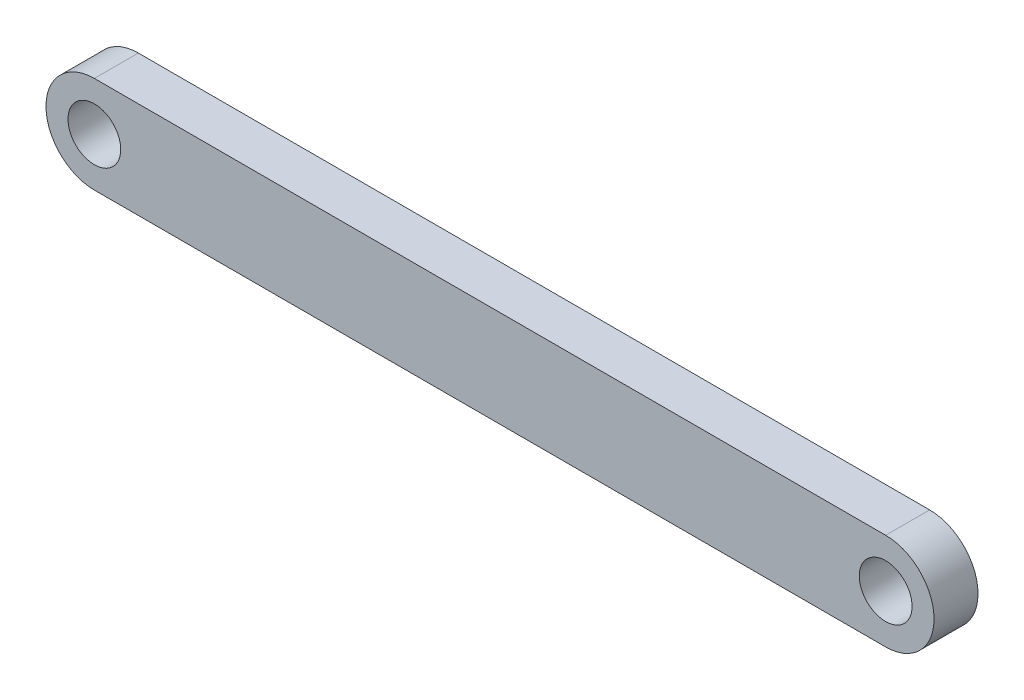
ISO-10303-21;
HEADER;
FILE_DESCRIPTION(('STEP AP214'),'2;1');
FILE_NAME('part.step','',(''),(''),'','','');
FILE_SCHEMA(('AUTOMOTIVE_DESIGN { 1 0 10303 214 1 1 1 1 }'));
ENDSEC;
DATA;
#1=APPLICATION_CONTEXT('core data for automotive mechanical design processes');
#2=APPLICATION_PROTOCOL_DEFINITION('international standard','automotive_design',2000,#1);
#3=PRODUCT_CONTEXT('',#1,'mechanical');
#4=PRODUCT('Part','Part','',(#3));
#5=PRODUCT_RELATED_PRODUCT_CATEGORY('part','',(#4));
#6=PRODUCT_DEFINITION_FORMATION('','',#4);
#7=PRODUCT_DEFINITION_CONTEXT('part definition',#1,'design');
#8=PRODUCT_DEFINITION('design','',#6,#7);
#9=PRODUCT_DEFINITION_SHAPE('','',#8);
#10=(LENGTH_UNIT() NAMED_UNIT(*) SI_UNIT(.MILLI.,.METRE.));
#11=(NAMED_UNIT(*) PLANE_ANGLE_UNIT() SI_UNIT($,.RADIAN.));
#12=(NAMED_UNIT(*) SI_UNIT($,.STERADIAN.) SOLID_ANGLE_UNIT());
#13=UNCERTAINTY_MEASURE_WITH_UNIT(LENGTH_MEASURE(1.E-05),#10,'distance_accuracy_value','');
#14=(GEOMETRIC_REPRESENTATION_CONTEXT(3) GLOBAL_UNCERTAINTY_ASSIGNED_CONTEXT((#13)) GLOBAL_UNIT_ASSIGNED_CONTEXT((#10,
#11,#12)) REPRESENTATION_CONTEXT('',''));
#15=CARTESIAN_POINT('',(0.,0.,0.));
#16=DIRECTION('',(0.,0.,1.));
#17=DIRECTION('',(1.,0.,0.));
#18=AXIS2_PLACEMENT_3D('',#15,#16,#17);
#19=CARTESIAN_POINT('',(-45.,0.,2.5));
#20=DIRECTION('',(0.,0.,1.));
#21=DIRECTION('',(1.,0.,0.));
#22=AXIS2_PLACEMENT_3D('',#19,#20,#21);
#23=PLANE('',#22);
#24=CARTESIAN_POINT('',(-45.,0.,2.5));
#25=DIRECTION('',(0.,0.,1.));
#26=DIRECTION('',(1.,0.,0.));
#27=AXIS2_PLACEMENT_3D('',#24,#25,#26);
#28=CIRCLE('',#27,3.);
#29=CARTESIAN_POINT('',(-42.,0.,2.5));
#30=VERTEX_POINT('',#29);
#31=EDGE_CURVE('E103',#30,#30,#28,.T.);
#32=ORIENTED_EDGE('',*,*,#31,.F.);
#33=EDGE_LOOP('',(#32));
#34=FACE_BOUND('',#33,.T.);
#35=CARTESIAN_POINT('',(-45.,0.,2.5));
#36=DIRECTION('',(0.,0.,1.));
#37=DIRECTION('',(1.,0.,0.));
#38=AXIS2_PLACEMENT_3D('',#35,#36,#37);
#39=CIRCLE('',#38,5.5);
#40=CARTESIAN_POINT('',(-45.,5.5,2.5));
#41=VERTEX_POINT('',#40);
#42=CARTESIAN_POINT('',(-45.,-5.5,2.5));
#43=VERTEX_POINT('',#42);
#44=EDGE_CURVE('E88',#41,#43,#39,.T.);
#45=ORIENTED_EDGE('',*,*,#44,.T.);
#46=DIRECTION('',(1.,0.,0.));
#47=VECTOR('',#46,1.);
#48=CARTESIAN_POINT('',(-45.,-5.5,2.5));
#49=LINE('',#48,#47);
#50=CARTESIAN_POINT('',(45.,-5.5,2.5));
#51=VERTEX_POINT('',#50);
#52=EDGE_CURVE('E83',#43,#51,#49,.T.);
#53=ORIENTED_EDGE('',*,*,#52,.T.);
#54=CARTESIAN_POINT('',(45.,0.,2.5));
#55=DIRECTION('',(0.,0.,1.));
#56=DIRECTION('',(1.,0.,0.));
#57=AXIS2_PLACEMENT_3D('',#54,#55,#56);
#58=CIRCLE('',#57,5.5);
#59=CARTESIAN_POINT('',(45.,5.5,2.5));
#60=VERTEX_POINT('',#59);
#61=EDGE_CURVE('E86',#51,#60,#58,.T.);
#62=ORIENTED_EDGE('',*,*,#61,.T.);
#63=DIRECTION('',(-1.,0.,0.));
#64=VECTOR('',#63,1.);
#65=CARTESIAN_POINT('',(-45.,5.5,2.5));
#66=LINE('',#65,#64);
#67=EDGE_CURVE('E53',#60,#41,#66,.T.);
#68=ORIENTED_EDGE('',*,*,#67,.T.);
#69=EDGE_LOOP('',(#45,#53,#62,#68));
#70=FACE_BOUND('',#69,.T.);
#71=CARTESIAN_POINT('',(45.,0.,2.5));
#72=DIRECTION('',(0.,0.,1.));
#73=DIRECTION('',(1.,0.,0.));
#74=AXIS2_PLACEMENT_3D('',#71,#72,#73);
#75=CIRCLE('',#74,3.);
#76=CARTESIAN_POINT('',(48.,0.,2.5));
#77=VERTEX_POINT('',#76);
#78=EDGE_CURVE('E118',#77,#77,#75,.T.);
#79=ORIENTED_EDGE('',*,*,#78,.F.);
#80=EDGE_LOOP('',(#79));
#81=FACE_BOUND('',#80,.T.);
#82=ADVANCED_FACE('F36',(#34,#70,#81),#23,.T.);
#83=CARTESIAN_POINT('',(-45.,0.,-2.5));
#84=DIRECTION('',(0.,0.,1.));
#85=DIRECTION('',(1.,0.,0.));
#86=AXIS2_PLACEMENT_3D('',#83,#84,#85);
#87=PLANE('',#86);
#88=CARTESIAN_POINT('',(-45.,0.,-2.5));
#89=DIRECTION('',(0.,0.,1.));
#90=DIRECTION('',(1.,0.,0.));
#91=AXIS2_PLACEMENT_3D('',#88,#89,#90);
#92=CIRCLE('',#91,5.5);
#93=CARTESIAN_POINT('',(-45.,5.5,-2.5));
#94=VERTEX_POINT('',#93);
#95=CARTESIAN_POINT('',(-45.,-5.5,-2.5));
#96=VERTEX_POINT('',#95);
#97=EDGE_CURVE('E100',#94,#96,#92,.T.);
#98=ORIENTED_EDGE('',*,*,#97,.F.);
#99=DIRECTION('',(-1.,0.,0.));
#100=VECTOR('',#99,1.);
#101=CARTESIAN_POINT('',(-45.,5.5,-2.5));
#102=LINE('',#101,#100);
#103=CARTESIAN_POINT('',(45.,5.5,-2.5));
#104=VERTEX_POINT('',#103);
#105=EDGE_CURVE('E76',#104,#94,#102,.T.);
#106=ORIENTED_EDGE('',*,*,#105,.F.);
#107=CARTESIAN_POINT('',(45.,0.,-2.5));
#108=DIRECTION('',(0.,0.,1.));
#109=DIRECTION('',(1.,0.,0.));
#110=AXIS2_PLACEMENT_3D('',#107,#108,#109);
#111=CIRCLE('',#110,5.5);
#112=CARTESIAN_POINT('',(45.,-5.5,-2.5));
#113=VERTEX_POINT('',#112);
#114=EDGE_CURVE('E70',#113,#104,#111,.T.);
#115=ORIENTED_EDGE('',*,*,#114,.F.);
#116=DIRECTION('',(1.,0.,0.));
#117=VECTOR('',#116,1.);
#118=CARTESIAN_POINT('',(-45.,-5.5,-2.5));
#119=LINE('',#118,#117);
#120=EDGE_CURVE('E92',#96,#113,#119,.T.);
#121=ORIENTED_EDGE('',*,*,#120,.F.);
#122=EDGE_LOOP('',(#98,#106,#115,#121));
#123=FACE_BOUND('',#122,.T.);
#124=CARTESIAN_POINT('',(-45.,0.,-2.5));
#125=DIRECTION('',(0.,0.,1.));
#126=DIRECTION('',(1.,0.,0.));
#127=AXIS2_PLACEMENT_3D('',#124,#125,#126);
#128=CIRCLE('',#127,3.);
#129=CARTESIAN_POINT('',(-42.,0.,-2.5));
#130=VERTEX_POINT('',#129);
#131=EDGE_CURVE('E115',#130,#130,#128,.T.);
#132=ORIENTED_EDGE('',*,*,#131,.T.);
#133=EDGE_LOOP('',(#132));
#134=FACE_BOUND('',#133,.T.);
#135=CARTESIAN_POINT('',(45.,0.,-2.5));
#136=DIRECTION('',(0.,0.,1.));
#137=DIRECTION('',(1.,0.,0.));
#138=AXIS2_PLACEMENT_3D('',#135,#136,#137);
#139=CIRCLE('',#138,3.);
#140=CARTESIAN_POINT('',(48.,0.,-2.5));
#141=VERTEX_POINT('',#140);
#142=EDGE_CURVE('E121',#141,#141,#139,.T.);
#143=ORIENTED_EDGE('',*,*,#142,.T.);
#144=EDGE_LOOP('',(#143));
#145=FACE_BOUND('',#144,.T.);
#146=ADVANCED_FACE('F111',(#123,#134,#145),#87,.F.);
#147=CARTESIAN_POINT('',(-45.,0.,2.5));
#148=DIRECTION('',(0.,0.,-1.));
#149=DIRECTION('',(-1.,0.,0.));
#150=AXIS2_PLACEMENT_3D('',#147,#148,#149);
#151=CYLINDRICAL_SURFACE('',#150,5.5);
#152=ORIENTED_EDGE('',*,*,#97,.T.);
#153=DIRECTION('',(0.,0.,-1.));
#154=VECTOR('',#153,1.);
#155=CARTESIAN_POINT('',(-45.,-5.5,2.5));
#156=LINE('',#155,#154);
#157=EDGE_CURVE('E11',#43,#96,#156,.T.);
#158=ORIENTED_EDGE('',*,*,#157,.F.);
#159=ORIENTED_EDGE('',*,*,#44,.F.);
#160=DIRECTION('',(0.,0.,-1.));
#161=VECTOR('',#160,1.);
#162=CARTESIAN_POINT('',(-45.,5.5,2.5));
#163=LINE('',#162,#161);
#164=EDGE_CURVE('E96',#41,#94,#163,.T.);
#165=ORIENTED_EDGE('',*,*,#164,.T.);
#166=EDGE_LOOP('',(#152,#158,#159,#165));
#167=FACE_BOUND('',#166,.T.);
#168=ADVANCED_FACE('F38',(#167),#151,.T.);
#169=CARTESIAN_POINT('',(-45.,-5.5,2.5));
#170=DIRECTION('',(0.,1.,0.));
#171=DIRECTION('',(0.,0.,1.));
#172=AXIS2_PLACEMENT_3D('',#169,#170,#171);
#173=PLANE('',#172);
#174=ORIENTED_EDGE('',*,*,#120,.T.);
#175=DIRECTION('',(0.,0.,-1.));
#176=VECTOR('',#175,1.);
#177=CARTESIAN_POINT('',(45.,-5.5,2.5));
#178=LINE('',#177,#176);
#179=EDGE_CURVE('E45',#51,#113,#178,.T.);
#180=ORIENTED_EDGE('',*,*,#179,.F.);
#181=ORIENTED_EDGE('',*,*,#52,.F.);
#182=ORIENTED_EDGE('',*,*,#157,.T.);
#183=EDGE_LOOP('',(#174,#180,#181,#182));
#184=FACE_BOUND('',#183,.T.);
#185=ADVANCED_FACE('F91',(#184),#173,.F.);
#186=CARTESIAN_POINT('',(45.,0.,2.5));
#187=DIRECTION('',(0.,0.,-1.));
#188=DIRECTION('',(-1.,0.,0.));
#189=AXIS2_PLACEMENT_3D('',#186,#187,#188);
#190=CYLINDRICAL_SURFACE('',#189,5.5);
#191=ORIENTED_EDGE('',*,*,#114,.T.);
#192=DIRECTION('',(0.,0.,-1.));
#193=VECTOR('',#192,1.);
#194=CARTESIAN_POINT('',(45.,5.5,2.5));
#195=LINE('',#194,#193);
#196=EDGE_CURVE('E93',#60,#104,#195,.T.);
#197=ORIENTED_EDGE('',*,*,#196,.F.);
#198=ORIENTED_EDGE('',*,*,#61,.F.);
#199=ORIENTED_EDGE('',*,*,#179,.T.);
#200=EDGE_LOOP('',(#191,#197,#198,#199));
#201=FACE_BOUND('',#200,.T.);
#202=ADVANCED_FACE('F94',(#201),#190,.T.);
#203=CARTESIAN_POINT('',(-45.,5.5,2.5));
#204=DIRECTION('',(0.,-1.,0.));
#205=DIRECTION('',(0.,0.,-1.));
#206=AXIS2_PLACEMENT_3D('',#203,#204,#205);
#207=PLANE('',#206);
#208=ORIENTED_EDGE('',*,*,#105,.T.);
#209=ORIENTED_EDGE('',*,*,#164,.F.);
#210=ORIENTED_EDGE('',*,*,#67,.F.);
#211=ORIENTED_EDGE('',*,*,#196,.T.);
#212=EDGE_LOOP('',(#208,#209,#210,#211));
#213=FACE_BOUND('',#212,.T.);
#214=ADVANCED_FACE('F108',(#213),#207,.F.);
#215=CARTESIAN_POINT('',(-45.,0.,2.5));
#216=DIRECTION('',(0.,0.,-1.));
#217=DIRECTION('',(-1.,0.,0.));
#218=AXIS2_PLACEMENT_3D('',#215,#216,#217);
#219=CYLINDRICAL_SURFACE('',#218,3.);
#220=ORIENTED_EDGE('',*,*,#31,.T.);
#221=EDGE_LOOP('',(#220));
#222=FACE_BOUND('',#221,.T.);
#223=ORIENTED_EDGE('',*,*,#131,.F.);
#224=EDGE_LOOP('',(#223));
#225=FACE_BOUND('',#224,.T.);
#226=ADVANCED_FACE('F138',(#222,#225),#219,.F.);
#227=CARTESIAN_POINT('',(45.,0.,2.5));
#228=DIRECTION('',(0.,0.,-1.));
#229=DIRECTION('',(-1.,0.,0.));
#230=AXIS2_PLACEMENT_3D('',#227,#228,#229);
#231=CYLINDRICAL_SURFACE('',#230,3.);
#232=ORIENTED_EDGE('',*,*,#78,.T.);
#233=EDGE_LOOP('',(#232));
#234=FACE_BOUND('',#233,.T.);
#235=ORIENTED_EDGE('',*,*,#142,.F.);
#236=EDGE_LOOP('',(#235));
#237=FACE_BOUND('',#236,.T.);
#238=ADVANCED_FACE('F127',(#234,#237),#231,.F.);
#239=CLOSED_SHELL('',(#82,#146,#168,#185,#202,#214,#226,#238));
#240=MANIFOLD_SOLID_BREP('B2',#239);
#241=ADVANCED_BREP_SHAPE_REPRESENTATION('',(#18,#240),#14);
#242=SHAPE_DEFINITION_REPRESENTATION(#9,#241);
ENDSEC;
END-ISO-10303-21;
